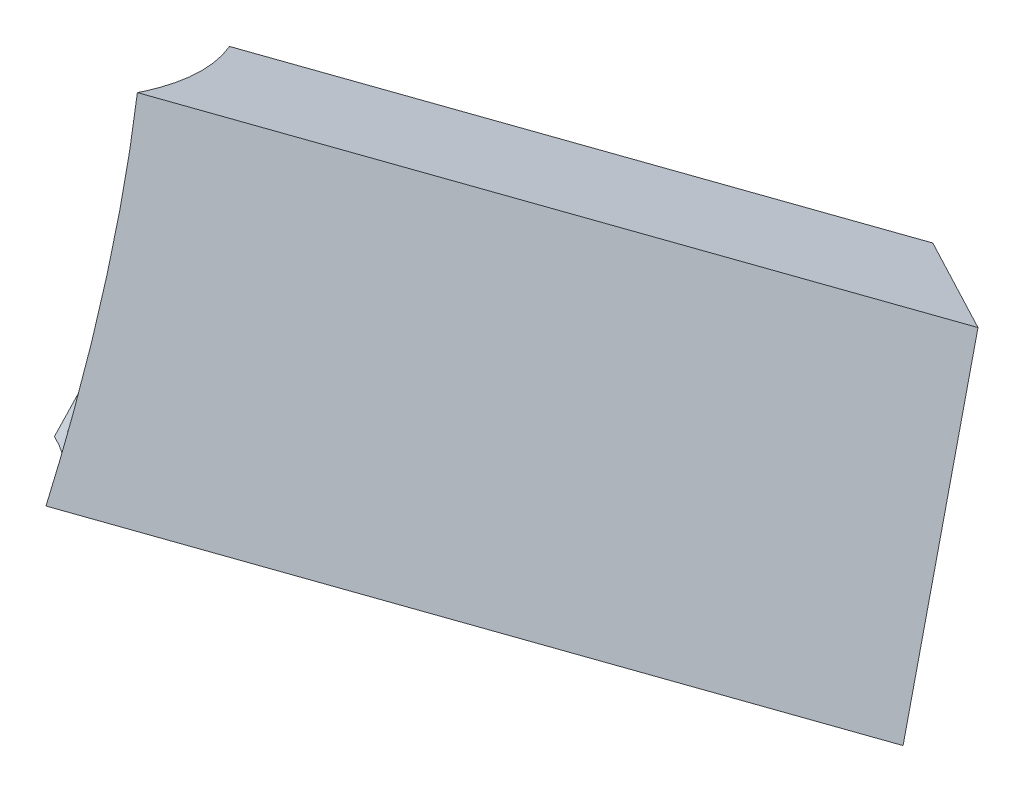
ISO-10303-21;
HEADER;
FILE_DESCRIPTION(('STEP AP214'),'2;1');
FILE_NAME('part.step','',(''),(''),'','','');
FILE_SCHEMA(('AUTOMOTIVE_DESIGN { 1 0 10303 214 1 1 1 1 }'));
ENDSEC;
DATA;
#1=APPLICATION_CONTEXT('core data for automotive mechanical design processes');
#2=APPLICATION_PROTOCOL_DEFINITION('international standard','automotive_design',2000,#1);
#3=PRODUCT_CONTEXT('',#1,'mechanical');
#4=PRODUCT('Part','Part','',(#3));
#5=PRODUCT_RELATED_PRODUCT_CATEGORY('part','',(#4));
#6=PRODUCT_DEFINITION_FORMATION('','',#4);
#7=PRODUCT_DEFINITION_CONTEXT('part definition',#1,'design');
#8=PRODUCT_DEFINITION('design','',#6,#7);
#9=PRODUCT_DEFINITION_SHAPE('','',#8);
#10=(LENGTH_UNIT() NAMED_UNIT(*) SI_UNIT(.MILLI.,.METRE.));
#11=(NAMED_UNIT(*) PLANE_ANGLE_UNIT() SI_UNIT($,.RADIAN.));
#12=(NAMED_UNIT(*) SI_UNIT($,.STERADIAN.) SOLID_ANGLE_UNIT());
#13=UNCERTAINTY_MEASURE_WITH_UNIT(LENGTH_MEASURE(1.E-05),#10,'distance_accuracy_value','');
#14=(GEOMETRIC_REPRESENTATION_CONTEXT(3) GLOBAL_UNCERTAINTY_ASSIGNED_CONTEXT((#13)) GLOBAL_UNIT_ASSIGNED_CONTEXT((#10,
#11,#12)) REPRESENTATION_CONTEXT('',''));
#15=CARTESIAN_POINT('',(0.,0.,0.));
#16=DIRECTION('',(0.,0.,1.));
#17=DIRECTION('',(1.,0.,0.));
#18=AXIS2_PLACEMENT_3D('',#15,#16,#17);
#19=CARTESIAN_POINT('',(152.700000000008,493.150380334973,267.608142586965));
#20=DIRECTION('',(0.519686820333586,-0.192188471774975,-0.832459728808767));
#21=DIRECTION('',(-0.84827320894695,0.,-0.529558838074528));
#22=AXIS2_PLACEMENT_3D('',#19,#20,#21);
#23=PLANE('',#22);
#24=DIRECTION('',(0.,-0.974370064785231,0.224951054343883));
#25=VECTOR('',#24,1.);
#26=CARTESIAN_POINT('',(162.352000000008,528.624710705303,265.443785454839));
#27=LINE('',#26,#25);
#28=CARTESIAN_POINT('',(162.352000000008,528.624710705303,265.443785454839));
#29=VERTEX_POINT('',#28);
#30=CARTESIAN_POINT('',(162.352000000008,460.317471683599,281.213754168563));
#31=VERTEX_POINT('',#30);
#32=EDGE_CURVE('E93',#29,#31,#27,.T.);
#33=ORIENTED_EDGE('',*,*,#32,.F.);
#34=DIRECTION('',(0.854356839249015,0.116904098162658,0.506367280796467));
#35=VECTOR('',#34,1.);
#36=CARTESIAN_POINT('',(145.654758024145,526.339979167709,255.547525920532));
#37=LINE('',#36,#35);
#38=CARTESIAN_POINT('',(143.048000000008,525.983288986346,254.002531005367));
#39=VERTEX_POINT('',#38);
#40=EDGE_CURVE('E90',#39,#29,#37,.T.);
#41=ORIENTED_EDGE('',*,*,#40,.F.);
#42=DIRECTION('',(0.,0.974370064785231,-0.224951054343883));
#43=VECTOR('',#42,1.);
#44=CARTESIAN_POINT('',(143.048000000008,525.983288986346,254.002531005367));
#45=LINE('',#44,#43);
#46=CARTESIAN_POINT('',(143.048000000008,457.676049964642,269.77249971909));
#47=VERTEX_POINT('',#46);
#48=EDGE_CURVE('E85',#47,#39,#45,.T.);
#49=ORIENTED_EDGE('',*,*,#48,.F.);
#50=DIRECTION('',(-0.854356839249015,-0.116904098162658,-0.506367280796467));
#51=VECTOR('',#50,1.);
#52=CARTESIAN_POINT('',(145.654758024145,458.032740146004,271.317494634256));
#53=LINE('',#52,#51);
#54=EDGE_CURVE('E150',#31,#47,#53,.T.);
#55=ORIENTED_EDGE('',*,*,#54,.F.);
#56=EDGE_LOOP('',(#33,#41,#49,#55));
#57=FACE_BOUND('',#56,.T.);
#58=DIRECTION('',(0.854356839249015,0.116904098162658,0.506367280796467));
#59=VECTOR('',#58,1.);
#60=CARTESIAN_POINT('',(143.429944768609,529.005431542611,253.543254377554));
#61=LINE('',#60,#59);
#62=CARTESIAN_POINT('',(140.000000000008,528.536102356608,251.510366331283));
#63=VERTEX_POINT('',#62);
#64=CARTESIAN_POINT('',(165.400000000008,532.011657249972,266.564648501642));
#65=VERTEX_POINT('',#64);
#66=EDGE_CURVE('E147',#63,#65,#61,.T.);
#67=ORIENTED_EDGE('',*,*,#66,.T.);
#68=DIRECTION('',(0.,-0.974370064785231,0.224951054343883));
#69=VECTOR('',#68,1.);
#70=CARTESIAN_POINT('',(165.400000000008,532.011657249972,266.564648501642));
#71=LINE('',#70,#69);
#72=CARTESIAN_POINT('',(165.400000000008,457.764658313338,283.705918842646));
#73=VERTEX_POINT('',#72);
#74=EDGE_CURVE('E145',#65,#73,#71,.T.);
#75=ORIENTED_EDGE('',*,*,#74,.T.);
#76=DIRECTION('',(-0.854356839249015,-0.116904098162658,-0.506367280796467));
#77=VECTOR('',#76,1.);
#78=CARTESIAN_POINT('',(143.429944768609,454.758432605976,270.684524718558));
#79=LINE('',#78,#77);
#80=CARTESIAN_POINT('',(140.000000000008,454.289103419973,268.651636672287));
#81=VERTEX_POINT('',#80);
#82=EDGE_CURVE('E114',#73,#81,#79,.T.);
#83=ORIENTED_EDGE('',*,*,#82,.T.);
#84=DIRECTION('',(0.,0.974370064785231,-0.224951054343883));
#85=VECTOR('',#84,1.);
#86=CARTESIAN_POINT('',(140.000000000008,528.536102356608,251.510366331283));
#87=LINE('',#86,#85);
#88=EDGE_CURVE('E140',#81,#63,#87,.T.);
#89=ORIENTED_EDGE('',*,*,#88,.T.);
#90=EDGE_LOOP('',(#67,#75,#83,#89));
#91=FACE_BOUND('',#90,.T.);
#92=ADVANCED_FACE('F40',(#57,#91),#23,.T.);
#93=CARTESIAN_POINT('',(146.85988953721,527.736983281932,248.049001338645));
#94=DIRECTION('',(0.,-0.974370064785232,0.224951054343881));
#95=DIRECTION('',(0.,-0.224951054343881,-0.974370064785232));
#96=AXIS2_PLACEMENT_3D('',#93,#94,#95);
#97=PLANE('',#96);
#98=ORIENTED_EDGE('',*,*,#66,.F.);
#99=DIRECTION('',(-0.887995978439146,0.103444016227646,0.448065260629071));
#100=VECTOR('',#99,1.);
#101=CARTESIAN_POINT('',(146.85988953721,527.736983281932,248.049001338645));
#102=LINE('',#101,#100);
#103=CARTESIAN_POINT('',(33.0725937670497,540.99224023798,305.463827051201));
#104=VERTEX_POINT('',#103);
#105=EDGE_CURVE('E143',#63,#104,#102,.T.);
#106=ORIENTED_EDGE('',*,*,#105,.T.);
#107=CARTESIAN_POINT('',(-4.88498130835069E-12,545.441831346092,324.737123586416));
#108=DIRECTION('',(0.,-0.974370064785232,0.224951054343881));
#109=DIRECTION('',(0.,-0.224951054343881,-0.974370064785232));
#110=AXIS2_PLACEMENT_3D('',#107,#108,#109);
#111=ELLIPSE('',#110,39.8408559221603,38.1);
#112=CARTESIAN_POINT('',(37.5922025299443,546.900183996176,331.053942906455));
#113=VERTEX_POINT('',#112);
#114=EDGE_CURVE('E132',#113,#104,#111,.F.);
#115=ORIENTED_EDGE('',*,*,#114,.F.);
#116=DIRECTION('',(-0.887995978439146,0.103444016227646,0.448065260629071));
#117=VECTOR('',#116,1.);
#118=CARTESIAN_POINT('',(158.540110462806,532.810776324648,270.026013494281));
#119=LINE('',#118,#117);
#120=EDGE_CURVE('E131',#65,#113,#119,.T.);
#121=ORIENTED_EDGE('',*,*,#120,.F.);
#122=EDGE_LOOP('',(#98,#106,#115,#121));
#123=FACE_BOUND('',#122,.T.);
#124=ADVANCED_FACE('F172',(#123),#97,.F.);
#125=CARTESIAN_POINT('',(158.540110462806,532.810776324648,270.026013494281));
#126=DIRECTION('',(-0.459851217543135,-0.199755631603012,-0.865236699040776));
#127=DIRECTION('',(-0.88303358136935,0.,0.469309806177134));
#128=AXIS2_PLACEMENT_3D('',#125,#126,#127);
#129=PLANE('',#128);
#130=ORIENTED_EDGE('',*,*,#74,.F.);
#131=ORIENTED_EDGE('',*,*,#120,.T.);
#132=CARTESIAN_POINT('',(-5.52335954751015E-12,468.575510617685,369.115914550579));
#133=DIRECTION('',(-0.459851217543135,-0.199755631603012,-0.865236699040776));
#134=DIRECTION('',(0.123628089728889,0.95047931378405,-0.285140613555117));
#135=AXIS2_PLACEMENT_3D('',#132,#133,#134);
#136=ELLIPSE('',#135,146.750178018493,38.1);
#137=CARTESIAN_POINT('',(35.0909450628351,472.944560385894,349.457298443915));
#138=VERTEX_POINT('',#137);
#139=EDGE_CURVE('E119',#138,#113,#136,.F.);
#140=ORIENTED_EDGE('',*,*,#139,.F.);
#141=DIRECTION('',(-0.887995978439146,0.103444016227646,0.448065260629071));
#142=VECTOR('',#141,1.);
#143=CARTESIAN_POINT('',(158.540110462806,458.563777388013,287.167283835284));
#144=LINE('',#143,#142);
#145=EDGE_CURVE('E43',#73,#138,#144,.T.);
#146=ORIENTED_EDGE('',*,*,#145,.F.);
#147=EDGE_LOOP('',(#130,#131,#140,#146));
#148=FACE_BOUND('',#147,.T.);
#149=ADVANCED_FACE('F130',(#148),#129,.F.);
#150=CARTESIAN_POINT('',(146.85988953721,527.736983281932,248.049001338645));
#151=DIRECTION('',(0.459851217543135,0.199755631603012,0.865236699040776));
#152=DIRECTION('',(0.88303358136935,0.,-0.469309806177134));
#153=AXIS2_PLACEMENT_3D('',#150,#151,#152);
#154=PLANE('',#153);
#155=ORIENTED_EDGE('',*,*,#88,.F.);
#156=DIRECTION('',(-0.887995978439146,0.103444016227646,0.448065260629071));
#157=VECTOR('',#156,1.);
#158=CARTESIAN_POINT('',(146.85988953721,453.489984345297,265.190271679649));
#159=LINE('',#158,#157);
#160=CARTESIAN_POINT('',(17.8537114720336,468.518112288734,330.284245302295));
#161=VERTEX_POINT('',#160);
#162=EDGE_CURVE('E120',#81,#161,#159,.T.);
#163=ORIENTED_EDGE('',*,*,#162,.T.);
#164=CARTESIAN_POINT('',(-4.77395900588817E-12,553.301765400287,320.199188544413));
#165=DIRECTION('',(0.459851217543135,0.199755631603012,0.865236699040776));
#166=DIRECTION('',(0.123628089728889,0.95047931378405,-0.285140613555117));
#167=AXIS2_PLACEMENT_3D('',#164,#165,#166);
#168=ELLIPSE('',#167,146.750178018493,38.1);
#169=EDGE_CURVE('E128',#104,#161,#168,.F.);
#170=ORIENTED_EDGE('',*,*,#169,.F.);
#171=ORIENTED_EDGE('',*,*,#105,.F.);
#172=EDGE_LOOP('',(#155,#163,#170,#171));
#173=FACE_BOUND('',#172,.T.);
#174=ADVANCED_FACE('F167',(#173),#154,.F.);
#175=CARTESIAN_POINT('',(146.85988953721,453.489984345297,265.190271679649));
#176=DIRECTION('',(0.,0.974370064785232,-0.224951054343881));
#177=DIRECTION('',(0.,0.224951054343881,0.974370064785232));
#178=AXIS2_PLACEMENT_3D('',#175,#176,#177);
#179=PLANE('',#178);
#180=ORIENTED_EDGE('',*,*,#82,.F.);
#181=ORIENTED_EDGE('',*,*,#145,.T.);
#182=CARTESIAN_POINT('',(-5.44009282066327E-12,476.435444671879,364.577979508577));
#183=DIRECTION('',(0.,0.974370064785232,-0.224951054343881));
#184=DIRECTION('',(0.,-0.224951054343881,-0.974370064785232));
#185=AXIS2_PLACEMENT_3D('',#182,#183,#184);
#186=ELLIPSE('',#185,39.8408559221603,38.1);
#187=EDGE_CURVE('E112',#161,#138,#186,.F.);
#188=ORIENTED_EDGE('',*,*,#187,.F.);
#189=ORIENTED_EDGE('',*,*,#162,.F.);
#190=EDGE_LOOP('',(#180,#181,#188,#189));
#191=FACE_BOUND('',#190,.T.);
#192=ADVANCED_FACE('F110',(#191),#179,.F.);
#193=CARTESIAN_POINT('',(-6.27276008913213E-12,383.632903652674,418.157551547498));
#194=DIRECTION('',(0.,0.866025403784432,-0.500000000000012));
#195=DIRECTION('',(0.,0.500000000000012,0.866025403784432));
#196=AXIS2_PLACEMENT_3D('',#193,#194,#195);
#197=CYLINDRICAL_SURFACE('',#196,38.1);
#198=CARTESIAN_POINT('',(-5.39845945723982E-12,479.195700138848,362.98434527169));
#199=DIRECTION('',(0.,0.974370064785232,-0.22495105434388));
#200=DIRECTION('',(0.,-0.22495105434388,-0.974370064785232));
#201=AXIS2_PLACEMENT_3D('',#198,#199,#200);
#202=ELLIPSE('',#201,39.8408559221603,38.1);
#203=CARTESIAN_POINT('',(21.6388010611159,471.819194134389,331.033187476866));
#204=VERTEX_POINT('',#203);
#205=CARTESIAN_POINT('',(34.2006031948843,475.246024844398,345.876422022528));
#206=VERTEX_POINT('',#205);
#207=EDGE_CURVE('E155',#204,#206,#202,.F.);
#208=ORIENTED_EDGE('',*,*,#207,.F.);
#209=CARTESIAN_POINT('',(-4.88498130835069E-12,543.134614826374,326.069195665154));
#210=DIRECTION('',(0.459851217543135,0.199755631603011,0.865236699040776));
#211=DIRECTION('',(0.123628089728889,0.95047931378405,-0.285140613555117));
#212=AXIS2_PLACEMENT_3D('',#209,#210,#211);
#213=ELLIPSE('',#212,146.750178018493,38.1);
#214=CARTESIAN_POINT('',(34.0842673910575,538.676641656746,308.983481860981));
#215=VERTEX_POINT('',#214);
#216=EDGE_CURVE('E11',#215,#204,#213,.F.);
#217=ORIENTED_EDGE('',*,*,#216,.F.);
#218=CARTESIAN_POINT('',(-4.87110352054287E-12,542.681575879124,326.330757823302));
#219=DIRECTION('',(0.,-0.974370064785232,0.22495105434388));
#220=DIRECTION('',(0.,-0.22495105434388,-0.974370064785232));
#221=AXIS2_PLACEMENT_3D('',#218,#219,#220);
#222=ELLIPSE('',#221,39.8408559221603,38.1);
#223=CARTESIAN_POINT('',(38.057665446098,543.103948756808,328.160255752943));
#224=VERTEX_POINT('',#223);
#225=EDGE_CURVE('E160',#224,#215,#222,.F.);
#226=ORIENTED_EDGE('',*,*,#225,.F.);
#227=CARTESIAN_POINT('',(-5.42621503285545E-12,478.742661191597,363.245907429839));
#228=DIRECTION('',(-0.459851217543135,-0.199755631603011,-0.865236699040776));
#229=DIRECTION('',(0.123628089728889,0.95047931378405,-0.285140613555117));
#230=AXIS2_PLACEMENT_3D('',#227,#228,#229);
#231=ELLIPSE('',#230,146.750178018493,38.1);
#232=EDGE_CURVE('E136',#206,#224,#231,.F.);
#233=ORIENTED_EDGE('',*,*,#232,.F.);
#234=EDGE_LOOP('',(#208,#217,#226,#233));
#235=FACE_BOUND('',#234,.T.);
#236=ORIENTED_EDGE('',*,*,#139,.T.);
#237=ORIENTED_EDGE('',*,*,#114,.T.);
#238=ORIENTED_EDGE('',*,*,#169,.T.);
#239=ORIENTED_EDGE('',*,*,#187,.T.);
#240=EDGE_LOOP('',(#236,#237,#238,#239));
#241=FACE_BOUND('',#240,.T.);
#242=ADVANCED_FACE('F124',(#235,#241),#197,.F.);
#243=CARTESIAN_POINT('',(148.261516048282,525.375958489592,251.371893610961));
#244=DIRECTION('',(0.,-0.974370064785232,0.22495105434388));
#245=DIRECTION('',(0.,-0.22495105434388,-0.974370064785232));
#246=AXIS2_PLACEMENT_3D('',#243,#244,#245);
#247=PLANE('',#246);
#248=DIRECTION('',(-0.887995978439146,0.103444016227646,0.448065260629071));
#249=VECTOR('',#248,1.);
#250=CARTESIAN_POINT('',(148.261516048282,525.375958489592,251.371893610961));
#251=LINE('',#250,#249);
#252=EDGE_CURVE('E49',#39,#215,#251,.T.);
#253=ORIENTED_EDGE('',*,*,#252,.F.);
#254=ORIENTED_EDGE('',*,*,#40,.T.);
#255=DIRECTION('',(-0.887995978439146,0.103444016227646,0.448065260629071));
#256=VECTOR('',#255,1.);
#257=CARTESIAN_POINT('',(157.138483951735,529.232041202057,268.074422849245));
#258=LINE('',#257,#256);
#259=EDGE_CURVE('E157',#29,#224,#258,.T.);
#260=ORIENTED_EDGE('',*,*,#259,.T.);
#261=ORIENTED_EDGE('',*,*,#225,.T.);
#262=EDGE_LOOP('',(#253,#254,#260,#261));
#263=FACE_BOUND('',#262,.T.);
#264=ADVANCED_FACE('F185',(#263),#247,.T.);
#265=CARTESIAN_POINT('',(157.138483951735,529.232041202057,268.074422849245));
#266=DIRECTION('',(-0.459851217543135,-0.199755631603011,-0.865236699040776));
#267=DIRECTION('',(-0.88303358136935,0.,0.469309806177134));
#268=AXIS2_PLACEMENT_3D('',#265,#266,#267);
#269=PLANE('',#268);
#270=ORIENTED_EDGE('',*,*,#259,.F.);
#271=ORIENTED_EDGE('',*,*,#32,.T.);
#272=DIRECTION('',(-0.887995978439146,0.103444016227646,0.448065260629071));
#273=VECTOR('',#272,1.);
#274=CARTESIAN_POINT('',(157.138483951734,460.924802180353,283.844391562968));
#275=LINE('',#274,#273);
#276=EDGE_CURVE('E159',#31,#206,#275,.T.);
#277=ORIENTED_EDGE('',*,*,#276,.T.);
#278=ORIENTED_EDGE('',*,*,#232,.T.);
#279=EDGE_LOOP('',(#270,#271,#277,#278));
#280=FACE_BOUND('',#279,.T.);
#281=ADVANCED_FACE('F182',(#280),#269,.T.);
#282=CARTESIAN_POINT('',(148.261516048282,457.068719467888,267.141862324685));
#283=DIRECTION('',(0.,0.974370064785232,-0.22495105434388));
#284=DIRECTION('',(0.,0.22495105434388,0.974370064785232));
#285=AXIS2_PLACEMENT_3D('',#282,#283,#284);
#286=PLANE('',#285);
#287=ORIENTED_EDGE('',*,*,#276,.F.);
#288=ORIENTED_EDGE('',*,*,#54,.T.);
#289=DIRECTION('',(-0.887995978439146,0.103444016227646,0.448065260629071));
#290=VECTOR('',#289,1.);
#291=CARTESIAN_POINT('',(148.261516048282,457.068719467888,267.141862324685));
#292=LINE('',#291,#290);
#293=EDGE_CURVE('E153',#47,#204,#292,.T.);
#294=ORIENTED_EDGE('',*,*,#293,.T.);
#295=ORIENTED_EDGE('',*,*,#207,.T.);
#296=EDGE_LOOP('',(#287,#288,#294,#295));
#297=FACE_BOUND('',#296,.T.);
#298=ADVANCED_FACE('F184',(#297),#286,.T.);
#299=CARTESIAN_POINT('',(148.261516048282,525.375958489592,251.371893610961));
#300=DIRECTION('',(0.459851217543135,0.199755631603011,0.865236699040776));
#301=DIRECTION('',(0.88303358136935,0.,-0.469309806177134));
#302=AXIS2_PLACEMENT_3D('',#299,#300,#301);
#303=PLANE('',#302);
#304=ORIENTED_EDGE('',*,*,#293,.F.);
#305=ORIENTED_EDGE('',*,*,#48,.T.);
#306=ORIENTED_EDGE('',*,*,#252,.T.);
#307=ORIENTED_EDGE('',*,*,#216,.T.);
#308=EDGE_LOOP('',(#304,#305,#306,#307));
#309=FACE_BOUND('',#308,.T.);
#310=ADVANCED_FACE('F203',(#309),#303,.T.);
#311=CLOSED_SHELL('',(#92,#124,#149,#174,#192,#242,#264,#281,#298,#310));
#312=MANIFOLD_SOLID_BREP('B2',#311);
#313=ADVANCED_BREP_SHAPE_REPRESENTATION('',(#18,#312),#14);
#314=SHAPE_DEFINITION_REPRESENTATION(#9,#313);
ENDSEC;
END-ISO-10303-21;
